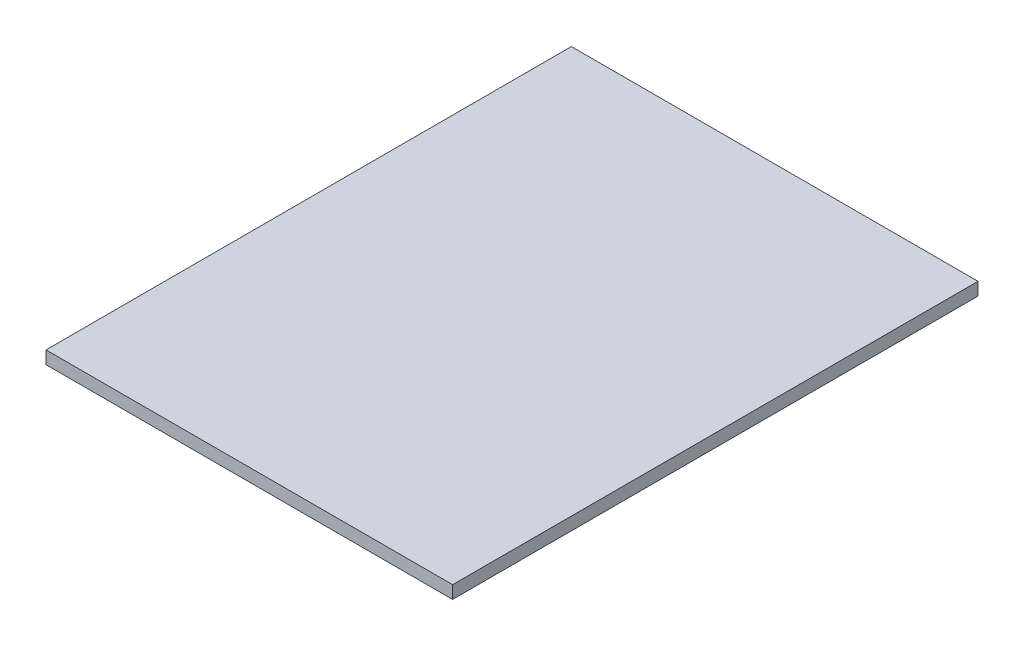
ISO-10303-21;
HEADER;
FILE_DESCRIPTION(('STEP AP214'),'2;1');
FILE_NAME('part.step','',(''),(''),'','','');
FILE_SCHEMA(('AUTOMOTIVE_DESIGN { 1 0 10303 214 1 1 1 1 }'));
ENDSEC;
DATA;
#1=APPLICATION_CONTEXT('core data for automotive mechanical design processes');
#2=APPLICATION_PROTOCOL_DEFINITION('international standard','automotive_design',2000,#1);
#3=PRODUCT_CONTEXT('',#1,'mechanical');
#4=PRODUCT('Part','Part','',(#3));
#5=PRODUCT_RELATED_PRODUCT_CATEGORY('part','',(#4));
#6=PRODUCT_DEFINITION_FORMATION('','',#4);
#7=PRODUCT_DEFINITION_CONTEXT('part definition',#1,'design');
#8=PRODUCT_DEFINITION('design','',#6,#7);
#9=PRODUCT_DEFINITION_SHAPE('','',#8);
#10=(LENGTH_UNIT() NAMED_UNIT(*) SI_UNIT(.MILLI.,.METRE.));
#11=(NAMED_UNIT(*) PLANE_ANGLE_UNIT() SI_UNIT($,.RADIAN.));
#12=(NAMED_UNIT(*) SI_UNIT($,.STERADIAN.) SOLID_ANGLE_UNIT());
#13=UNCERTAINTY_MEASURE_WITH_UNIT(LENGTH_MEASURE(1.E-05),#10,'distance_accuracy_value','');
#14=(GEOMETRIC_REPRESENTATION_CONTEXT(3) GLOBAL_UNCERTAINTY_ASSIGNED_CONTEXT((#13)) GLOBAL_UNIT_ASSIGNED_CONTEXT((#10,
#11,#12)) REPRESENTATION_CONTEXT('',''));
#15=CARTESIAN_POINT('',(0.,0.,0.));
#16=DIRECTION('',(0.,0.,1.));
#17=DIRECTION('',(1.,0.,0.));
#18=AXIS2_PLACEMENT_3D('',#15,#16,#17);
#19=CARTESIAN_POINT('',(-6.35,0.4,-8.205));
#20=DIRECTION('',(1.,0.,0.));
#21=DIRECTION('',(0.,0.,-1.));
#22=AXIS2_PLACEMENT_3D('',#19,#20,#21);
#23=PLANE('',#22);
#24=DIRECTION('',(0.,0.,1.));
#25=VECTOR('',#24,1.);
#26=CARTESIAN_POINT('',(-6.35,0.,-8.205));
#27=LINE('',#26,#25);
#28=CARTESIAN_POINT('',(-6.35,0.,-8.205));
#29=VERTEX_POINT('',#28);
#30=CARTESIAN_POINT('',(-6.35,0.,8.20500000000001));
#31=VERTEX_POINT('',#30);
#32=EDGE_CURVE('E95',#29,#31,#27,.T.);
#33=ORIENTED_EDGE('',*,*,#32,.T.);
#34=DIRECTION('',(0.,-1.,0.));
#35=VECTOR('',#34,1.);
#36=CARTESIAN_POINT('',(-6.35,0.4,8.20500000000001));
#37=LINE('',#36,#35);
#38=CARTESIAN_POINT('',(-6.35,0.4,8.20500000000001));
#39=VERTEX_POINT('',#38);
#40=EDGE_CURVE('E11',#39,#31,#37,.T.);
#41=ORIENTED_EDGE('',*,*,#40,.F.);
#42=DIRECTION('',(0.,0.,1.));
#43=VECTOR('',#42,1.);
#44=CARTESIAN_POINT('',(-6.35,0.4,-8.205));
#45=LINE('',#44,#43);
#46=CARTESIAN_POINT('',(-6.35,0.4,-8.205));
#47=VERTEX_POINT('',#46);
#48=EDGE_CURVE('E83',#47,#39,#45,.T.);
#49=ORIENTED_EDGE('',*,*,#48,.F.);
#50=DIRECTION('',(0.,-1.,0.));
#51=VECTOR('',#50,1.);
#52=CARTESIAN_POINT('',(-6.35,0.4,-8.205));
#53=LINE('',#52,#51);
#54=EDGE_CURVE('E91',#47,#29,#53,.T.);
#55=ORIENTED_EDGE('',*,*,#54,.T.);
#56=EDGE_LOOP('',(#33,#41,#49,#55));
#57=FACE_BOUND('',#56,.T.);
#58=ADVANCED_FACE('F32',(#57),#23,.F.);
#59=CARTESIAN_POINT('',(-6.35,0.4,8.20500000000001));
#60=DIRECTION('',(0.,0.,-1.));
#61=DIRECTION('',(-1.,0.,0.));
#62=AXIS2_PLACEMENT_3D('',#59,#60,#61);
#63=PLANE('',#62);
#64=DIRECTION('',(1.,0.,0.));
#65=VECTOR('',#64,1.);
#66=CARTESIAN_POINT('',(-6.35,0.,8.20500000000001));
#67=LINE('',#66,#65);
#68=CARTESIAN_POINT('',(6.35,0.,8.205));
#69=VERTEX_POINT('',#68);
#70=EDGE_CURVE('E87',#31,#69,#67,.T.);
#71=ORIENTED_EDGE('',*,*,#70,.T.);
#72=DIRECTION('',(0.,-1.,0.));
#73=VECTOR('',#72,1.);
#74=CARTESIAN_POINT('',(6.35,0.4,8.205));
#75=LINE('',#74,#73);
#76=CARTESIAN_POINT('',(6.35,0.4,8.205));
#77=VERTEX_POINT('',#76);
#78=EDGE_CURVE('E40',#77,#69,#75,.T.);
#79=ORIENTED_EDGE('',*,*,#78,.F.);
#80=DIRECTION('',(1.,0.,0.));
#81=VECTOR('',#80,1.);
#82=CARTESIAN_POINT('',(-6.35,0.4,8.20500000000001));
#83=LINE('',#82,#81);
#84=EDGE_CURVE('E78',#39,#77,#83,.T.);
#85=ORIENTED_EDGE('',*,*,#84,.F.);
#86=ORIENTED_EDGE('',*,*,#40,.T.);
#87=EDGE_LOOP('',(#71,#79,#85,#86));
#88=FACE_BOUND('',#87,.T.);
#89=ADVANCED_FACE('F86',(#88),#63,.F.);
#90=CARTESIAN_POINT('',(6.35,0.4,-8.205));
#91=DIRECTION('',(-1.,0.,0.));
#92=DIRECTION('',(0.,0.,1.));
#93=AXIS2_PLACEMENT_3D('',#90,#91,#92);
#94=PLANE('',#93);
#95=DIRECTION('',(0.,0.,-1.));
#96=VECTOR('',#95,1.);
#97=CARTESIAN_POINT('',(6.35,0.,-8.205));
#98=LINE('',#97,#96);
#99=CARTESIAN_POINT('',(6.35,0.,-8.205));
#100=VERTEX_POINT('',#99);
#101=EDGE_CURVE('E65',#69,#100,#98,.T.);
#102=ORIENTED_EDGE('',*,*,#101,.T.);
#103=DIRECTION('',(0.,-1.,0.));
#104=VECTOR('',#103,1.);
#105=CARTESIAN_POINT('',(6.35,0.4,-8.205));
#106=LINE('',#105,#104);
#107=CARTESIAN_POINT('',(6.35,0.4,-8.205));
#108=VERTEX_POINT('',#107);
#109=EDGE_CURVE('E88',#108,#100,#106,.T.);
#110=ORIENTED_EDGE('',*,*,#109,.F.);
#111=DIRECTION('',(0.,0.,-1.));
#112=VECTOR('',#111,1.);
#113=CARTESIAN_POINT('',(6.35,0.4,-8.205));
#114=LINE('',#113,#112);
#115=EDGE_CURVE('E81',#77,#108,#114,.T.);
#116=ORIENTED_EDGE('',*,*,#115,.F.);
#117=ORIENTED_EDGE('',*,*,#78,.T.);
#118=EDGE_LOOP('',(#102,#110,#116,#117));
#119=FACE_BOUND('',#118,.T.);
#120=ADVANCED_FACE('F89',(#119),#94,.F.);
#121=CARTESIAN_POINT('',(-6.35,0.4,-8.205));
#122=DIRECTION('',(0.,0.,1.));
#123=DIRECTION('',(1.,0.,0.));
#124=AXIS2_PLACEMENT_3D('',#121,#122,#123);
#125=PLANE('',#124);
#126=DIRECTION('',(-1.,0.,0.));
#127=VECTOR('',#126,1.);
#128=CARTESIAN_POINT('',(-6.35,0.,-8.205));
#129=LINE('',#128,#127);
#130=EDGE_CURVE('E71',#100,#29,#129,.T.);
#131=ORIENTED_EDGE('',*,*,#130,.T.);
#132=ORIENTED_EDGE('',*,*,#54,.F.);
#133=DIRECTION('',(-1.,0.,0.));
#134=VECTOR('',#133,1.);
#135=CARTESIAN_POINT('',(-6.35,0.4,-8.205));
#136=LINE('',#135,#134);
#137=EDGE_CURVE('E48',#108,#47,#136,.T.);
#138=ORIENTED_EDGE('',*,*,#137,.F.);
#139=ORIENTED_EDGE('',*,*,#109,.T.);
#140=EDGE_LOOP('',(#131,#132,#138,#139));
#141=FACE_BOUND('',#140,.T.);
#142=ADVANCED_FACE('F102',(#141),#125,.F.);
#143=CARTESIAN_POINT('',(0.,0.4,0.));
#144=DIRECTION('',(0.,1.,0.));
#145=DIRECTION('',(0.,0.,1.));
#146=AXIS2_PLACEMENT_3D('',#143,#144,#145);
#147=PLANE('',#146);
#148=ORIENTED_EDGE('',*,*,#48,.T.);
#149=ORIENTED_EDGE('',*,*,#84,.T.);
#150=ORIENTED_EDGE('',*,*,#115,.T.);
#151=ORIENTED_EDGE('',*,*,#137,.T.);
#152=EDGE_LOOP('',(#148,#149,#150,#151));
#153=FACE_BOUND('',#152,.T.);
#154=ADVANCED_FACE('F79',(#153),#147,.T.);
#155=CARTESIAN_POINT('',(0.,0.,0.));
#156=DIRECTION('',(0.,1.,0.));
#157=DIRECTION('',(0.,0.,1.));
#158=AXIS2_PLACEMENT_3D('',#155,#156,#157);
#159=PLANE('',#158);
#160=ORIENTED_EDGE('',*,*,#32,.F.);
#161=ORIENTED_EDGE('',*,*,#130,.F.);
#162=ORIENTED_EDGE('',*,*,#101,.F.);
#163=ORIENTED_EDGE('',*,*,#70,.F.);
#164=EDGE_LOOP('',(#160,#161,#162,#163));
#165=FACE_BOUND('',#164,.T.);
#166=ADVANCED_FACE('F105',(#165),#159,.F.);
#167=CLOSED_SHELL('',(#58,#89,#120,#142,#154,#166));
#168=MANIFOLD_SOLID_BREP('B2',#167);
#169=ADVANCED_BREP_SHAPE_REPRESENTATION('',(#18,#168),#14);
#170=SHAPE_DEFINITION_REPRESENTATION(#9,#169);
ENDSEC;
END-ISO-10303-21;
